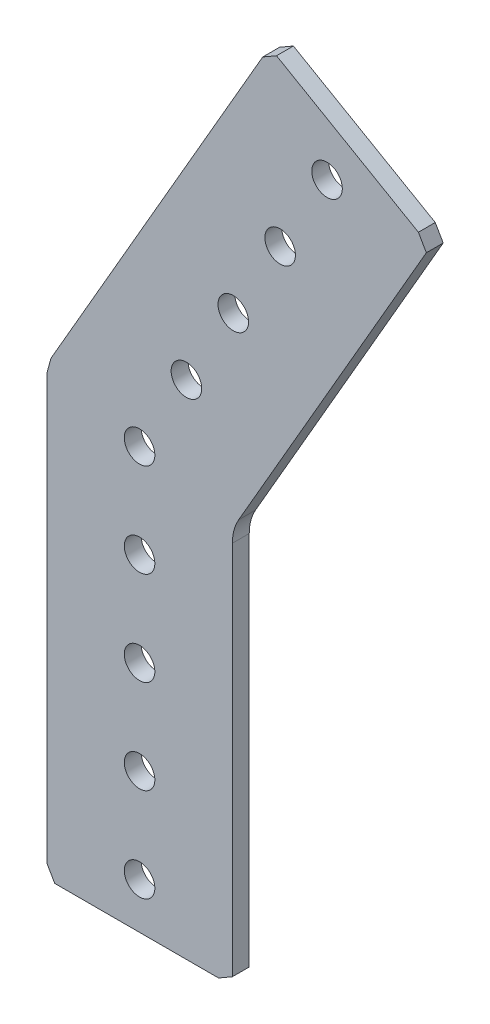
ISO-10303-21;
HEADER;
FILE_DESCRIPTION(('STEP AP214'),'2;1');
FILE_NAME('part.step','',(''),(''),'','','');
FILE_SCHEMA(('AUTOMOTIVE_DESIGN { 1 0 10303 214 1 1 1 1 }'));
ENDSEC;
DATA;
#1=APPLICATION_CONTEXT('core data for automotive mechanical design processes');
#2=APPLICATION_PROTOCOL_DEFINITION('international standard','automotive_design',2000,#1);
#3=PRODUCT_CONTEXT('',#1,'mechanical');
#4=PRODUCT('Part','Part','',(#3));
#5=PRODUCT_RELATED_PRODUCT_CATEGORY('part','',(#4));
#6=PRODUCT_DEFINITION_FORMATION('','',#4);
#7=PRODUCT_DEFINITION_CONTEXT('part definition',#1,'design');
#8=PRODUCT_DEFINITION('design','',#6,#7);
#9=PRODUCT_DEFINITION_SHAPE('','',#8);
#10=(LENGTH_UNIT() NAMED_UNIT(*) SI_UNIT(.MILLI.,.METRE.));
#11=(NAMED_UNIT(*) PLANE_ANGLE_UNIT() SI_UNIT($,.RADIAN.));
#12=(NAMED_UNIT(*) SI_UNIT($,.STERADIAN.) SOLID_ANGLE_UNIT());
#13=UNCERTAINTY_MEASURE_WITH_UNIT(LENGTH_MEASURE(1.E-05),#10,'distance_accuracy_value','');
#14=(GEOMETRIC_REPRESENTATION_CONTEXT(3) GLOBAL_UNCERTAINTY_ASSIGNED_CONTEXT((#13)) GLOBAL_UNIT_ASSIGNED_CONTEXT((#10,
#11,#12)) REPRESENTATION_CONTEXT('',''));
#15=CARTESIAN_POINT('',(0.,0.,0.));
#16=DIRECTION('',(0.,0.,1.));
#17=DIRECTION('',(1.,0.,0.));
#18=AXIS2_PLACEMENT_3D('',#15,#16,#17);
#19=CARTESIAN_POINT('',(18.5578370216028,55.1301165999988,0.));
#20=DIRECTION('',(-0.499999999999878,0.866025403784509,0.));
#21=DIRECTION('',(-0.866025403784509,-0.499999999999878,0.));
#22=AXIS2_PLACEMENT_3D('',#19,#20,#21);
#23=PLANE('',#22);
#24=DIRECTION('',(-0.866025403784509,-0.499999999999878,0.));
#25=VECTOR('',#24,1.);
#26=CARTESIAN_POINT('',(18.5578370216028,55.1301165999988,2.286));
#27=LINE('',#26,#25);
#28=CARTESIAN_POINT('',(18.5578370216028,55.1301165999988,2.286));
#29=VERTEX_POINT('',#28);
#30=CARTESIAN_POINT('',(16.6880881748319,54.050616599999,2.286));
#31=VERTEX_POINT('',#30);
#32=EDGE_CURVE('E153',#29,#31,#27,.T.);
#33=ORIENTED_EDGE('',*,*,#32,.F.);
#34=DIRECTION('',(0.,0.,1.));
#35=VECTOR('',#34,1.);
#36=CARTESIAN_POINT('',(18.5578370216028,55.1301165999988,0.));
#37=LINE('',#36,#35);
#38=CARTESIAN_POINT('',(18.5578370216028,55.1301165999988,0.));
#39=VERTEX_POINT('',#38);
#40=EDGE_CURVE('E11',#39,#29,#37,.T.);
#41=ORIENTED_EDGE('',*,*,#40,.F.);
#42=DIRECTION('',(-0.866025403784509,-0.499999999999878,0.));
#43=VECTOR('',#42,1.);
#44=CARTESIAN_POINT('',(18.5578370216028,55.1301165999988,0.));
#45=LINE('',#44,#43);
#46=CARTESIAN_POINT('',(16.6880881748319,54.050616599999,0.));
#47=VERTEX_POINT('',#46);
#48=EDGE_CURVE('E186',#39,#47,#45,.T.);
#49=ORIENTED_EDGE('',*,*,#48,.T.);
#50=DIRECTION('',(0.,0.,1.));
#51=VECTOR('',#50,1.);
#52=CARTESIAN_POINT('',(16.6880881748319,54.050616599999,0.));
#53=LINE('',#52,#51);
#54=EDGE_CURVE('E35',#47,#31,#53,.T.);
#55=ORIENTED_EDGE('',*,*,#54,.T.);
#56=EDGE_LOOP('',(#33,#41,#49,#55));
#57=FACE_BOUND('',#56,.T.);
#58=ADVANCED_FACE('F32',(#57),#23,.T.);
#59=CARTESIAN_POINT('',(37.7807874017826,44.0317410233832,0.));
#60=DIRECTION('',(0.5,0.866025403784439,0.));
#61=DIRECTION('',(-0.866025403784439,0.5,0.));
#62=AXIS2_PLACEMENT_3D('',#59,#60,#61);
#63=PLANE('',#62);
#64=DIRECTION('',(-0.866025403784439,0.5,0.));
#65=VECTOR('',#64,1.);
#66=CARTESIAN_POINT('',(37.7807874017826,44.0317410233832,2.286));
#67=LINE('',#66,#65);
#68=CARTESIAN_POINT('',(37.7807874017826,44.0317410233832,2.286));
#69=VERTEX_POINT('',#68);
#70=EDGE_CURVE('E184',#69,#29,#67,.T.);
#71=ORIENTED_EDGE('',*,*,#70,.F.);
#72=DIRECTION('',(0.,0.,1.));
#73=VECTOR('',#72,1.);
#74=CARTESIAN_POINT('',(37.7807874017826,44.0317410233832,0.));
#75=LINE('',#74,#73);
#76=CARTESIAN_POINT('',(37.7807874017826,44.0317410233832,0.));
#77=VERTEX_POINT('',#76);
#78=EDGE_CURVE('E41',#77,#69,#75,.T.);
#79=ORIENTED_EDGE('',*,*,#78,.F.);
#80=DIRECTION('',(-0.866025403784439,0.5,0.));
#81=VECTOR('',#80,1.);
#82=CARTESIAN_POINT('',(37.7807874017826,44.0317410233832,0.));
#83=LINE('',#82,#81);
#84=EDGE_CURVE('E143',#77,#39,#83,.T.);
#85=ORIENTED_EDGE('',*,*,#84,.T.);
#86=ORIENTED_EDGE('',*,*,#40,.T.);
#87=EDGE_LOOP('',(#71,#79,#85,#86));
#88=FACE_BOUND('',#87,.T.);
#89=ADVANCED_FACE('F206',(#88),#63,.T.);
#90=CARTESIAN_POINT('',(38.8602874017829,42.161992176612,0.));
#91=DIRECTION('',(0.866025403784439,0.499999999999999,0.));
#92=DIRECTION('',(-0.499999999999999,0.866025403784439,0.));
#93=AXIS2_PLACEMENT_3D('',#90,#91,#92);
#94=PLANE('',#93);
#95=DIRECTION('',(-0.499999999999999,0.866025403784439,0.));
#96=VECTOR('',#95,1.);
#97=CARTESIAN_POINT('',(38.8602874017829,42.161992176612,2.286));
#98=LINE('',#97,#96);
#99=CARTESIAN_POINT('',(38.8602874017829,42.161992176612,2.286));
#100=VERTEX_POINT('',#99);
#101=EDGE_CURVE('E130',#100,#69,#98,.T.);
#102=ORIENTED_EDGE('',*,*,#101,.F.);
#103=DIRECTION('',(0.,0.,1.));
#104=VECTOR('',#103,1.);
#105=CARTESIAN_POINT('',(38.8602874017829,42.161992176612,0.));
#106=LINE('',#105,#104);
#107=CARTESIAN_POINT('',(38.8602874017829,42.161992176612,0.));
#108=VERTEX_POINT('',#107);
#109=EDGE_CURVE('E125',#108,#100,#106,.T.);
#110=ORIENTED_EDGE('',*,*,#109,.F.);
#111=DIRECTION('',(-0.499999999999999,0.866025403784439,0.));
#112=VECTOR('',#111,1.);
#113=CARTESIAN_POINT('',(38.8602874017829,42.161992176612,0.));
#114=LINE('',#113,#112);
#115=EDGE_CURVE('E128',#108,#77,#114,.T.);
#116=ORIENTED_EDGE('',*,*,#115,.T.);
#117=ORIENTED_EDGE('',*,*,#78,.T.);
#118=EDGE_LOOP('',(#102,#110,#116,#117));
#119=FACE_BOUND('',#118,.T.);
#120=ADVANCED_FACE('F127',(#119),#94,.T.);
#121=CARTESIAN_POINT('',(13.4237386859688,-1.89540256837896,0.));
#122=DIRECTION('',(0.866025403784439,-0.5,0.));
#123=DIRECTION('',(0.5,0.866025403784439,0.));
#124=AXIS2_PLACEMENT_3D('',#121,#122,#123);
#125=PLANE('',#124);
#126=DIRECTION('',(0.5,0.866025403784439,0.));
#127=VECTOR('',#126,1.);
#128=CARTESIAN_POINT('',(13.4237386859688,-1.89540256837896,2.286));
#129=LINE('',#128,#127);
#130=CARTESIAN_POINT('',(13.4237386859688,-1.89540256837896,2.286));
#131=VERTEX_POINT('',#130);
#132=EDGE_CURVE('E181',#131,#100,#129,.T.);
#133=ORIENTED_EDGE('',*,*,#132,.F.);
#134=DIRECTION('',(0.,0.,1.));
#135=VECTOR('',#134,1.);
#136=CARTESIAN_POINT('',(13.4237386859688,-1.89540256837896,0.));
#137=LINE('',#136,#135);
#138=CARTESIAN_POINT('',(13.4237386859688,-1.89540256837896,0.));
#139=VERTEX_POINT('',#138);
#140=EDGE_CURVE('E135',#139,#131,#137,.T.);
#141=ORIENTED_EDGE('',*,*,#140,.F.);
#142=DIRECTION('',(0.5,0.866025403784439,0.));
#143=VECTOR('',#142,1.);
#144=CARTESIAN_POINT('',(13.4237386859688,-1.89540256837896,0.));
#145=LINE('',#144,#143);
#146=EDGE_CURVE('E141',#139,#108,#145,.T.);
#147=ORIENTED_EDGE('',*,*,#146,.T.);
#148=ORIENTED_EDGE('',*,*,#109,.T.);
#149=EDGE_LOOP('',(#133,#141,#147,#148));
#150=FACE_BOUND('',#149,.T.);
#151=ADVANCED_FACE('F145',(#150),#125,.T.);
#152=CARTESIAN_POINT('',(18.923,-5.07040256837896,0.));
#153=DIRECTION('',(0.,0.,1.));
#154=DIRECTION('',(1.,0.,0.));
#155=AXIS2_PLACEMENT_3D('',#152,#153,#154);
#156=CYLINDRICAL_SURFACE('',#155,6.35);
#157=CARTESIAN_POINT('',(18.923,-5.07040256837896,2.286));
#158=DIRECTION('',(0.,0.,-1.));
#159=DIRECTION('',(-1.,0.,0.));
#160=AXIS2_PLACEMENT_3D('',#157,#158,#159);
#161=CIRCLE('',#160,6.35);
#162=CARTESIAN_POINT('',(12.573,-5.07040256837896,2.286));
#163=VERTEX_POINT('',#162);
#164=EDGE_CURVE('E178',#163,#131,#161,.T.);
#165=ORIENTED_EDGE('',*,*,#164,.F.);
#166=DIRECTION('',(0.,0.,1.));
#167=VECTOR('',#166,1.);
#168=CARTESIAN_POINT('',(12.573,-5.07040256837896,0.));
#169=LINE('',#168,#167);
#170=CARTESIAN_POINT('',(12.573,-5.07040256837896,0.));
#171=VERTEX_POINT('',#170);
#172=EDGE_CURVE('E190',#171,#163,#169,.T.);
#173=ORIENTED_EDGE('',*,*,#172,.F.);
#174=CARTESIAN_POINT('',(18.923,-5.07040256837896,0.));
#175=DIRECTION('',(0.,0.,-1.));
#176=DIRECTION('',(-1.,0.,0.));
#177=AXIS2_PLACEMENT_3D('',#174,#175,#176);
#178=CIRCLE('',#177,6.35);
#179=EDGE_CURVE('E146',#171,#139,#178,.T.);
#180=ORIENTED_EDGE('',*,*,#179,.T.);
#181=ORIENTED_EDGE('',*,*,#140,.T.);
#182=EDGE_LOOP('',(#165,#173,#180,#181));
#183=FACE_BOUND('',#182,.T.);
#184=ADVANCED_FACE('F219',(#183),#156,.F.);
#185=CARTESIAN_POINT('',(12.573,-55.9435,0.));
#186=DIRECTION('',(1.,0.,0.));
#187=DIRECTION('',(0.,1.,0.));
#188=AXIS2_PLACEMENT_3D('',#185,#186,#187);
#189=PLANE('',#188);
#190=DIRECTION('',(0.,1.,0.));
#191=VECTOR('',#190,1.);
#192=CARTESIAN_POINT('',(12.573,-55.9435,2.286));
#193=LINE('',#192,#191);
#194=CARTESIAN_POINT('',(12.573,-55.9435,2.286));
#195=VERTEX_POINT('',#194);
#196=EDGE_CURVE('E175',#195,#163,#193,.T.);
#197=ORIENTED_EDGE('',*,*,#196,.F.);
#198=DIRECTION('',(0.,0.,1.));
#199=VECTOR('',#198,1.);
#200=CARTESIAN_POINT('',(12.573,-55.9435,0.));
#201=LINE('',#200,#199);
#202=CARTESIAN_POINT('',(12.573,-55.9435,0.));
#203=VERTEX_POINT('',#202);
#204=EDGE_CURVE('E192',#203,#195,#201,.T.);
#205=ORIENTED_EDGE('',*,*,#204,.F.);
#206=DIRECTION('',(0.,1.,0.));
#207=VECTOR('',#206,1.);
#208=CARTESIAN_POINT('',(12.573,-55.9435,0.));
#209=LINE('',#208,#207);
#210=EDGE_CURVE('E148',#203,#171,#209,.T.);
#211=ORIENTED_EDGE('',*,*,#210,.T.);
#212=ORIENTED_EDGE('',*,*,#172,.T.);
#213=EDGE_LOOP('',(#197,#205,#211,#212));
#214=FACE_BOUND('',#213,.T.);
#215=ADVANCED_FACE('F222',(#214),#189,.T.);
#216=CARTESIAN_POINT('',(10.7032511532294,-57.023,0.));
#217=DIRECTION('',(0.500000000000003,-0.866025403784437,0.));
#218=DIRECTION('',(0.866025403784437,0.500000000000003,0.));
#219=AXIS2_PLACEMENT_3D('',#216,#217,#218);
#220=PLANE('',#219);
#221=DIRECTION('',(0.866025403784437,0.500000000000003,0.));
#222=VECTOR('',#221,1.);
#223=CARTESIAN_POINT('',(10.7032511532294,-57.023,2.286));
#224=LINE('',#223,#222);
#225=CARTESIAN_POINT('',(10.7032511532294,-57.023,2.286));
#226=VERTEX_POINT('',#225);
#227=EDGE_CURVE('E172',#226,#195,#224,.T.);
#228=ORIENTED_EDGE('',*,*,#227,.F.);
#229=DIRECTION('',(0.,0.,1.));
#230=VECTOR('',#229,1.);
#231=CARTESIAN_POINT('',(10.7032511532294,-57.023,0.));
#232=LINE('',#231,#230);
#233=CARTESIAN_POINT('',(10.7032511532294,-57.023,0.));
#234=VERTEX_POINT('',#233);
#235=EDGE_CURVE('E194',#234,#226,#232,.T.);
#236=ORIENTED_EDGE('',*,*,#235,.F.);
#237=DIRECTION('',(0.866025403784437,0.500000000000003,0.));
#238=VECTOR('',#237,1.);
#239=CARTESIAN_POINT('',(10.7032511532294,-57.023,0.));
#240=LINE('',#239,#238);
#241=EDGE_CURVE('E366',#234,#203,#240,.T.);
#242=ORIENTED_EDGE('',*,*,#241,.T.);
#243=ORIENTED_EDGE('',*,*,#204,.T.);
#244=EDGE_LOOP('',(#228,#236,#242,#243));
#245=FACE_BOUND('',#244,.T.);
#246=ADVANCED_FACE('F226',(#245),#220,.T.);
#247=CARTESIAN_POINT('',(-11.4935,-57.023,0.));
#248=DIRECTION('',(0.,-1.,0.));
#249=DIRECTION('',(1.,0.,0.));
#250=AXIS2_PLACEMENT_3D('',#247,#248,#249);
#251=PLANE('',#250);
#252=DIRECTION('',(1.,0.,0.));
#253=VECTOR('',#252,1.);
#254=CARTESIAN_POINT('',(-11.4935,-57.023,2.286));
#255=LINE('',#254,#253);
#256=CARTESIAN_POINT('',(-11.4935,-57.023,2.286));
#257=VERTEX_POINT('',#256);
#258=EDGE_CURVE('E169',#257,#226,#255,.T.);
#259=ORIENTED_EDGE('',*,*,#258,.F.);
#260=DIRECTION('',(0.,0.,1.));
#261=VECTOR('',#260,1.);
#262=CARTESIAN_POINT('',(-11.4935,-57.023,0.));
#263=LINE('',#262,#261);
#264=CARTESIAN_POINT('',(-11.4935,-57.023,0.));
#265=VERTEX_POINT('',#264);
#266=EDGE_CURVE('E196',#265,#257,#263,.T.);
#267=ORIENTED_EDGE('',*,*,#266,.F.);
#268=DIRECTION('',(1.,0.,0.));
#269=VECTOR('',#268,1.);
#270=CARTESIAN_POINT('',(-11.4935,-57.023,0.));
#271=LINE('',#270,#269);
#272=EDGE_CURVE('E363',#265,#234,#271,.T.);
#273=ORIENTED_EDGE('',*,*,#272,.T.);
#274=ORIENTED_EDGE('',*,*,#235,.T.);
#275=EDGE_LOOP('',(#259,#267,#273,#274));
#276=FACE_BOUND('',#275,.T.);
#277=ADVANCED_FACE('F230',(#276),#251,.T.);
#278=CARTESIAN_POINT('',(-12.573,-55.1532511532294,0.));
#279=DIRECTION('',(-0.866025403784432,-0.500000000000011,0.));
#280=DIRECTION('',(0.500000000000011,-0.866025403784432,0.));
#281=AXIS2_PLACEMENT_3D('',#278,#279,#280);
#282=PLANE('',#281);
#283=DIRECTION('',(0.500000000000011,-0.866025403784432,0.));
#284=VECTOR('',#283,1.);
#285=CARTESIAN_POINT('',(-12.573,-55.1532511532294,2.286));
#286=LINE('',#285,#284);
#287=CARTESIAN_POINT('',(-12.573,-55.1532511532294,2.286));
#288=VERTEX_POINT('',#287);
#289=EDGE_CURVE('E166',#288,#257,#286,.T.);
#290=ORIENTED_EDGE('',*,*,#289,.F.);
#291=DIRECTION('',(0.,0.,1.));
#292=VECTOR('',#291,1.);
#293=CARTESIAN_POINT('',(-12.573,-55.1532511532294,0.));
#294=LINE('',#293,#292);
#295=CARTESIAN_POINT('',(-12.573,-55.1532511532294,0.));
#296=VERTEX_POINT('',#295);
#297=EDGE_CURVE('E198',#296,#288,#294,.T.);
#298=ORIENTED_EDGE('',*,*,#297,.F.);
#299=DIRECTION('',(0.500000000000011,-0.866025403784432,0.));
#300=VECTOR('',#299,1.);
#301=CARTESIAN_POINT('',(-12.573,-55.1532511532294,0.));
#302=LINE('',#301,#300);
#303=EDGE_CURVE('E360',#296,#265,#302,.T.);
#304=ORIENTED_EDGE('',*,*,#303,.T.);
#305=ORIENTED_EDGE('',*,*,#266,.T.);
#306=EDGE_LOOP('',(#290,#298,#304,#305));
#307=FACE_BOUND('',#306,.T.);
#308=ADVANCED_FACE('F234',(#307),#282,.T.);
#309=CARTESIAN_POINT('',(-12.573,2.25134455968378,0.));
#310=DIRECTION('',(-1.,0.,0.));
#311=DIRECTION('',(0.,-1.,0.));
#312=AXIS2_PLACEMENT_3D('',#309,#310,#311);
#313=PLANE('',#312);
#314=DIRECTION('',(0.,-1.,0.));
#315=VECTOR('',#314,1.);
#316=CARTESIAN_POINT('',(-12.573,2.25134455968378,2.286));
#317=LINE('',#316,#315);
#318=CARTESIAN_POINT('',(-12.573,2.25134455968378,2.286));
#319=VERTEX_POINT('',#318);
#320=EDGE_CURVE('E163',#319,#288,#317,.T.);
#321=ORIENTED_EDGE('',*,*,#320,.F.);
#322=DIRECTION('',(0.,0.,1.));
#323=VECTOR('',#322,1.);
#324=CARTESIAN_POINT('',(-12.573,2.25134455968378,0.));
#325=LINE('',#324,#323);
#326=CARTESIAN_POINT('',(-12.573,2.25134455968378,0.));
#327=VERTEX_POINT('',#326);
#328=EDGE_CURVE('E200',#327,#319,#325,.T.);
#329=ORIENTED_EDGE('',*,*,#328,.F.);
#330=DIRECTION('',(0.,-1.,0.));
#331=VECTOR('',#330,1.);
#332=CARTESIAN_POINT('',(-12.573,2.25134455968378,0.));
#333=LINE('',#332,#331);
#334=EDGE_CURVE('E357',#327,#296,#333,.T.);
#335=ORIENTED_EDGE('',*,*,#334,.T.);
#336=ORIENTED_EDGE('',*,*,#297,.T.);
#337=EDGE_LOOP('',(#321,#329,#335,#336));
#338=FACE_BOUND('',#337,.T.);
#339=ADVANCED_FACE('F238',(#338),#313,.T.);
#340=CARTESIAN_POINT('',(-12.0142096816236,4.33677841864197,0.));
#341=DIRECTION('',(-0.965925826289068,0.258819045102523,0.));
#342=DIRECTION('',(-0.258819045102523,-0.965925826289068,0.));
#343=AXIS2_PLACEMENT_3D('',#340,#341,#342);
#344=PLANE('',#343);
#345=DIRECTION('',(-0.258819045102523,-0.965925826289068,0.));
#346=VECTOR('',#345,1.);
#347=CARTESIAN_POINT('',(-12.0142096816236,4.33677841864197,2.286));
#348=LINE('',#347,#346);
#349=CARTESIAN_POINT('',(-12.0142096816236,4.33677841864197,2.286));
#350=VERTEX_POINT('',#349);
#351=EDGE_CURVE('E160',#350,#319,#348,.T.);
#352=ORIENTED_EDGE('',*,*,#351,.F.);
#353=DIRECTION('',(0.,0.,1.));
#354=VECTOR('',#353,1.);
#355=CARTESIAN_POINT('',(-12.0142096816236,4.33677841864197,0.));
#356=LINE('',#355,#354);
#357=CARTESIAN_POINT('',(-12.0142096816236,4.33677841864197,0.));
#358=VERTEX_POINT('',#357);
#359=EDGE_CURVE('E201',#358,#350,#356,.T.);
#360=ORIENTED_EDGE('',*,*,#359,.F.);
#361=DIRECTION('',(-0.258819045102523,-0.965925826289068,0.));
#362=VECTOR('',#361,1.);
#363=CARTESIAN_POINT('',(-12.0142096816236,4.33677841864197,0.));
#364=LINE('',#363,#362);
#365=EDGE_CURVE('E354',#358,#327,#364,.T.);
#366=ORIENTED_EDGE('',*,*,#365,.T.);
#367=ORIENTED_EDGE('',*,*,#328,.T.);
#368=EDGE_LOOP('',(#352,#360,#366,#367));
#369=FACE_BOUND('',#368,.T.);
#370=ADVANCED_FACE('F242',(#369),#344,.T.);
#371=CARTESIAN_POINT('',(16.6880881748319,54.050616599999,0.));
#372=DIRECTION('',(-0.866025403784442,0.499999999999995,0.));
#373=DIRECTION('',(-0.499999999999995,-0.866025403784442,0.));
#374=AXIS2_PLACEMENT_3D('',#371,#372,#373);
#375=PLANE('',#374);
#376=DIRECTION('',(-0.499999999999995,-0.866025403784442,0.));
#377=VECTOR('',#376,1.);
#378=CARTESIAN_POINT('',(16.6880881748319,54.050616599999,2.286));
#379=LINE('',#378,#377);
#380=EDGE_CURVE('E156',#31,#350,#379,.T.);
#381=ORIENTED_EDGE('',*,*,#380,.F.);
#382=ORIENTED_EDGE('',*,*,#54,.F.);
#383=DIRECTION('',(-0.499999999999995,-0.866025403784442,0.));
#384=VECTOR('',#383,1.);
#385=CARTESIAN_POINT('',(16.6880881748319,54.050616599999,0.));
#386=LINE('',#385,#384);
#387=EDGE_CURVE('E352',#47,#358,#386,.T.);
#388=ORIENTED_EDGE('',*,*,#387,.T.);
#389=ORIENTED_EDGE('',*,*,#359,.T.);
#390=EDGE_LOOP('',(#381,#382,#388,#389));
#391=FACE_BOUND('',#390,.T.);
#392=ADVANCED_FACE('F203',(#391),#375,.T.);
#393=CARTESIAN_POINT('',(18.923,-5.07040256837896,0.));
#394=DIRECTION('',(0.,0.,-1.));
#395=DIRECTION('',(-1.,0.,0.));
#396=AXIS2_PLACEMENT_3D('',#393,#394,#395);
#397=PLANE('',#396);
#398=CARTESIAN_POINT('',(25.3999999999997,43.9940905122496,0.));
#399=DIRECTION('',(0.,0.,1.));
#400=DIRECTION('',(-1.,0.,0.));
#401=AXIS2_PLACEMENT_3D('',#398,#399,#400);
#402=CIRCLE('',#401,2.0701);
#403=CARTESIAN_POINT('',(23.3298999999997,43.9940905122496,0.));
#404=VERTEX_POINT('',#403);
#405=EDGE_CURVE('E297',#404,#404,#402,.T.);
#406=ORIENTED_EDGE('',*,*,#405,.T.);
#407=EDGE_LOOP('',(#406));
#408=FACE_BOUND('',#407,.T.);
#409=CARTESIAN_POINT('',(12.7000000000001,21.9970452561247,0.));
#410=DIRECTION('',(0.,0.,1.));
#411=DIRECTION('',(-1.,0.,0.));
#412=AXIS2_PLACEMENT_3D('',#409,#410,#411);
#413=CIRCLE('',#412,2.0701);
#414=CARTESIAN_POINT('',(10.6299000000001,21.9970452561247,0.));
#415=VERTEX_POINT('',#414);
#416=EDGE_CURVE('E305',#415,#415,#413,.T.);
#417=ORIENTED_EDGE('',*,*,#416,.T.);
#418=EDGE_LOOP('',(#417));
#419=FACE_BOUND('',#418,.T.);
#420=CARTESIAN_POINT('',(6.35000000000005,10.9985226280623,0.));
#421=DIRECTION('',(0.,0.,1.));
#422=DIRECTION('',(-1.,0.,0.));
#423=AXIS2_PLACEMENT_3D('',#420,#421,#422);
#424=CIRCLE('',#423,2.0701);
#425=CARTESIAN_POINT('',(4.27990000000005,10.9985226280623,0.));
#426=VERTEX_POINT('',#425);
#427=EDGE_CURVE('E311',#426,#426,#424,.T.);
#428=ORIENTED_EDGE('',*,*,#427,.T.);
#429=EDGE_LOOP('',(#428));
#430=FACE_BOUND('',#429,.T.);
#431=CARTESIAN_POINT('',(19.0500000000001,32.995567884187,0.));
#432=DIRECTION('',(0.,0.,1.));
#433=DIRECTION('',(-1.,0.,0.));
#434=AXIS2_PLACEMENT_3D('',#431,#432,#433);
#435=CIRCLE('',#434,2.0701);
#436=CARTESIAN_POINT('',(16.9799000000001,32.995567884187,0.));
#437=VERTEX_POINT('',#436);
#438=EDGE_CURVE('E317',#437,#437,#435,.T.);
#439=ORIENTED_EDGE('',*,*,#438,.T.);
#440=EDGE_LOOP('',(#439));
#441=FACE_BOUND('',#440,.T.);
#442=CARTESIAN_POINT('',(0.,-50.8,0.));
#443=DIRECTION('',(0.,0.,1.));
#444=DIRECTION('',(-1.,0.,0.));
#445=AXIS2_PLACEMENT_3D('',#442,#443,#444);
#446=CIRCLE('',#445,2.0701);
#447=CARTESIAN_POINT('',(-2.07009999999999,-50.8,0.));
#448=VERTEX_POINT('',#447);
#449=EDGE_CURVE('E323',#448,#448,#446,.T.);
#450=ORIENTED_EDGE('',*,*,#449,.T.);
#451=EDGE_LOOP('',(#450));
#452=FACE_BOUND('',#451,.T.);
#453=CARTESIAN_POINT('',(2.66050878019847E-13,-25.4,0.));
#454=DIRECTION('',(0.,0.,1.));
#455=DIRECTION('',(-1.,0.,0.));
#456=AXIS2_PLACEMENT_3D('',#453,#454,#455);
#457=CIRCLE('',#456,2.0701);
#458=CARTESIAN_POINT('',(-2.07009999999973,-25.4,0.));
#459=VERTEX_POINT('',#458);
#460=EDGE_CURVE('E329',#459,#459,#457,.T.);
#461=ORIENTED_EDGE('',*,*,#460,.T.);
#462=EDGE_LOOP('',(#461));
#463=FACE_BOUND('',#462,.T.);
#464=CARTESIAN_POINT('',(1.33025439009923E-13,-12.7,0.));
#465=DIRECTION('',(0.,0.,1.));
#466=DIRECTION('',(-1.,0.,0.));
#467=AXIS2_PLACEMENT_3D('',#464,#465,#466);
#468=CIRCLE('',#467,2.0701);
#469=CARTESIAN_POINT('',(-2.07009999999987,-12.7,0.));
#470=VERTEX_POINT('',#469);
#471=EDGE_CURVE('E335',#470,#470,#468,.T.);
#472=ORIENTED_EDGE('',*,*,#471,.T.);
#473=EDGE_LOOP('',(#472));
#474=FACE_BOUND('',#473,.T.);
#475=CARTESIAN_POINT('',(3.9907631702977E-13,-38.1,0.));
#476=DIRECTION('',(0.,0.,1.));
#477=DIRECTION('',(-1.,0.,0.));
#478=AXIS2_PLACEMENT_3D('',#475,#476,#477);
#479=CIRCLE('',#478,2.0701);
#480=CARTESIAN_POINT('',(-2.0700999999996,-38.1,0.));
#481=VERTEX_POINT('',#480);
#482=EDGE_CURVE('E341',#481,#481,#479,.T.);
#483=ORIENTED_EDGE('',*,*,#482,.T.);
#484=EDGE_LOOP('',(#483));
#485=FACE_BOUND('',#484,.T.);
#486=CARTESIAN_POINT('',(0.,0.,0.));
#487=DIRECTION('',(0.,0.,1.));
#488=DIRECTION('',(-1.,0.,0.));
#489=AXIS2_PLACEMENT_3D('',#486,#487,#488);
#490=CIRCLE('',#489,2.0701);
#491=CARTESIAN_POINT('',(-2.0701,0.,0.));
#492=VERTEX_POINT('',#491);
#493=EDGE_CURVE('E157',#492,#492,#490,.T.);
#494=ORIENTED_EDGE('',*,*,#493,.T.);
#495=EDGE_LOOP('',(#494));
#496=FACE_BOUND('',#495,.T.);
#497=ORIENTED_EDGE('',*,*,#48,.F.);
#498=ORIENTED_EDGE('',*,*,#84,.F.);
#499=ORIENTED_EDGE('',*,*,#115,.F.);
#500=ORIENTED_EDGE('',*,*,#146,.F.);
#501=ORIENTED_EDGE('',*,*,#179,.F.);
#502=ORIENTED_EDGE('',*,*,#210,.F.);
#503=ORIENTED_EDGE('',*,*,#241,.F.);
#504=ORIENTED_EDGE('',*,*,#272,.F.);
#505=ORIENTED_EDGE('',*,*,#303,.F.);
#506=ORIENTED_EDGE('',*,*,#334,.F.);
#507=ORIENTED_EDGE('',*,*,#365,.F.);
#508=ORIENTED_EDGE('',*,*,#387,.F.);
#509=EDGE_LOOP('',(#497,#498,#499,#500,#501,#502,#503,#504,#505,#506,#507,#508));
#510=FACE_BOUND('',#509,.T.);
#511=ADVANCED_FACE('F139',(#408,#419,#430,#441,#452,#463,#474,#485,#496,#510),#397,.T.);
#512=CARTESIAN_POINT('',(18.923,-5.07040256837896,2.286));
#513=DIRECTION('',(0.,0.,-1.));
#514=DIRECTION('',(-1.,0.,0.));
#515=AXIS2_PLACEMENT_3D('',#512,#513,#514);
#516=PLANE('',#515);
#517=CARTESIAN_POINT('',(25.3999999999997,43.9940905122496,2.286));
#518=DIRECTION('',(0.,0.,1.));
#519=DIRECTION('',(-1.,0.,0.));
#520=AXIS2_PLACEMENT_3D('',#517,#518,#519);
#521=CIRCLE('',#520,2.0701);
#522=CARTESIAN_POINT('',(23.3298999999997,43.9940905122496,2.286));
#523=VERTEX_POINT('',#522);
#524=EDGE_CURVE('E300',#523,#523,#521,.T.);
#525=ORIENTED_EDGE('',*,*,#524,.F.);
#526=EDGE_LOOP('',(#525));
#527=FACE_BOUND('',#526,.T.);
#528=CARTESIAN_POINT('',(12.7000000000001,21.9970452561247,2.286));
#529=DIRECTION('',(0.,0.,1.));
#530=DIRECTION('',(-1.,0.,0.));
#531=AXIS2_PLACEMENT_3D('',#528,#529,#530);
#532=CIRCLE('',#531,2.0701);
#533=CARTESIAN_POINT('',(10.6299000000001,21.9970452561247,2.286));
#534=VERTEX_POINT('',#533);
#535=EDGE_CURVE('E302',#534,#534,#532,.T.);
#536=ORIENTED_EDGE('',*,*,#535,.F.);
#537=EDGE_LOOP('',(#536));
#538=FACE_BOUND('',#537,.T.);
#539=CARTESIAN_POINT('',(6.35000000000005,10.9985226280623,2.286));
#540=DIRECTION('',(0.,0.,1.));
#541=DIRECTION('',(-1.,0.,0.));
#542=AXIS2_PLACEMENT_3D('',#539,#540,#541);
#543=CIRCLE('',#542,2.0701);
#544=CARTESIAN_POINT('',(4.27990000000005,10.9985226280623,2.286));
#545=VERTEX_POINT('',#544);
#546=EDGE_CURVE('E308',#545,#545,#543,.T.);
#547=ORIENTED_EDGE('',*,*,#546,.F.);
#548=EDGE_LOOP('',(#547));
#549=FACE_BOUND('',#548,.T.);
#550=CARTESIAN_POINT('',(19.0500000000001,32.995567884187,2.286));
#551=DIRECTION('',(0.,0.,1.));
#552=DIRECTION('',(-1.,0.,0.));
#553=AXIS2_PLACEMENT_3D('',#550,#551,#552);
#554=CIRCLE('',#553,2.0701);
#555=CARTESIAN_POINT('',(16.9799000000001,32.995567884187,2.286));
#556=VERTEX_POINT('',#555);
#557=EDGE_CURVE('E314',#556,#556,#554,.T.);
#558=ORIENTED_EDGE('',*,*,#557,.F.);
#559=EDGE_LOOP('',(#558));
#560=FACE_BOUND('',#559,.T.);
#561=CARTESIAN_POINT('',(0.,-50.8,2.286));
#562=DIRECTION('',(0.,0.,1.));
#563=DIRECTION('',(-1.,0.,0.));
#564=AXIS2_PLACEMENT_3D('',#561,#562,#563);
#565=CIRCLE('',#564,2.0701);
#566=CARTESIAN_POINT('',(-2.07009999999999,-50.8,2.286));
#567=VERTEX_POINT('',#566);
#568=EDGE_CURVE('E320',#567,#567,#565,.T.);
#569=ORIENTED_EDGE('',*,*,#568,.F.);
#570=EDGE_LOOP('',(#569));
#571=FACE_BOUND('',#570,.T.);
#572=CARTESIAN_POINT('',(2.66050878019847E-13,-25.4,2.286));
#573=DIRECTION('',(0.,0.,1.));
#574=DIRECTION('',(-1.,0.,0.));
#575=AXIS2_PLACEMENT_3D('',#572,#573,#574);
#576=CIRCLE('',#575,2.0701);
#577=CARTESIAN_POINT('',(-2.07009999999973,-25.4,2.286));
#578=VERTEX_POINT('',#577);
#579=EDGE_CURVE('E326',#578,#578,#576,.T.);
#580=ORIENTED_EDGE('',*,*,#579,.F.);
#581=EDGE_LOOP('',(#580));
#582=FACE_BOUND('',#581,.T.);
#583=CARTESIAN_POINT('',(1.33025439009923E-13,-12.7,2.286));
#584=DIRECTION('',(0.,0.,1.));
#585=DIRECTION('',(-1.,0.,0.));
#586=AXIS2_PLACEMENT_3D('',#583,#584,#585);
#587=CIRCLE('',#586,2.0701);
#588=CARTESIAN_POINT('',(-2.07009999999987,-12.7,2.286));
#589=VERTEX_POINT('',#588);
#590=EDGE_CURVE('E332',#589,#589,#587,.T.);
#591=ORIENTED_EDGE('',*,*,#590,.F.);
#592=EDGE_LOOP('',(#591));
#593=FACE_BOUND('',#592,.T.);
#594=CARTESIAN_POINT('',(3.9907631702977E-13,-38.1,2.286));
#595=DIRECTION('',(0.,0.,1.));
#596=DIRECTION('',(-1.,0.,0.));
#597=AXIS2_PLACEMENT_3D('',#594,#595,#596);
#598=CIRCLE('',#597,2.0701);
#599=CARTESIAN_POINT('',(-2.0700999999996,-38.1,2.286));
#600=VERTEX_POINT('',#599);
#601=EDGE_CURVE('E338',#600,#600,#598,.T.);
#602=ORIENTED_EDGE('',*,*,#601,.F.);
#603=EDGE_LOOP('',(#602));
#604=FACE_BOUND('',#603,.T.);
#605=CARTESIAN_POINT('',(0.,0.,2.286));
#606=DIRECTION('',(0.,0.,1.));
#607=DIRECTION('',(-1.,0.,0.));
#608=AXIS2_PLACEMENT_3D('',#605,#606,#607);
#609=CIRCLE('',#608,2.0701);
#610=CARTESIAN_POINT('',(-2.0701,0.,2.286));
#611=VERTEX_POINT('',#610);
#612=EDGE_CURVE('E344',#611,#611,#609,.T.);
#613=ORIENTED_EDGE('',*,*,#612,.F.);
#614=EDGE_LOOP('',(#613));
#615=FACE_BOUND('',#614,.T.);
#616=ORIENTED_EDGE('',*,*,#32,.T.);
#617=ORIENTED_EDGE('',*,*,#380,.T.);
#618=ORIENTED_EDGE('',*,*,#351,.T.);
#619=ORIENTED_EDGE('',*,*,#320,.T.);
#620=ORIENTED_EDGE('',*,*,#289,.T.);
#621=ORIENTED_EDGE('',*,*,#258,.T.);
#622=ORIENTED_EDGE('',*,*,#227,.T.);
#623=ORIENTED_EDGE('',*,*,#196,.T.);
#624=ORIENTED_EDGE('',*,*,#164,.T.);
#625=ORIENTED_EDGE('',*,*,#132,.T.);
#626=ORIENTED_EDGE('',*,*,#101,.T.);
#627=ORIENTED_EDGE('',*,*,#70,.T.);
#628=EDGE_LOOP('',(#616,#617,#618,#619,#620,#621,#622,#623,#624,#625,#626,#627));
#629=FACE_BOUND('',#628,.T.);
#630=ADVANCED_FACE('F205',(#527,#538,#549,#560,#571,#582,#593,#604,#615,#629),#516,.F.);
#631=CARTESIAN_POINT('',(0.,0.,0.));
#632=DIRECTION('',(0.,0.,1.));
#633=DIRECTION('',(1.,0.,0.));
#634=AXIS2_PLACEMENT_3D('',#631,#632,#633);
#635=CYLINDRICAL_SURFACE('',#634,2.0701);
#636=ORIENTED_EDGE('',*,*,#493,.F.);
#637=EDGE_LOOP('',(#636));
#638=FACE_BOUND('',#637,.T.);
#639=ORIENTED_EDGE('',*,*,#612,.T.);
#640=EDGE_LOOP('',(#639));
#641=FACE_BOUND('',#640,.T.);
#642=ADVANCED_FACE('F254',(#638,#641),#635,.F.);
#643=CARTESIAN_POINT('',(3.9907631702977E-13,-38.1,0.));
#644=DIRECTION('',(0.,0.,1.));
#645=DIRECTION('',(1.,0.,0.));
#646=AXIS2_PLACEMENT_3D('',#643,#644,#645);
#647=CYLINDRICAL_SURFACE('',#646,2.0701);
#648=ORIENTED_EDGE('',*,*,#482,.F.);
#649=EDGE_LOOP('',(#648));
#650=FACE_BOUND('',#649,.T.);
#651=ORIENTED_EDGE('',*,*,#601,.T.);
#652=EDGE_LOOP('',(#651));
#653=FACE_BOUND('',#652,.T.);
#654=ADVANCED_FACE('F261',(#650,#653),#647,.F.);
#655=CARTESIAN_POINT('',(1.33025439009923E-13,-12.7,0.));
#656=DIRECTION('',(0.,0.,1.));
#657=DIRECTION('',(1.,0.,0.));
#658=AXIS2_PLACEMENT_3D('',#655,#656,#657);
#659=CYLINDRICAL_SURFACE('',#658,2.0701);
#660=ORIENTED_EDGE('',*,*,#471,.F.);
#661=EDGE_LOOP('',(#660));
#662=FACE_BOUND('',#661,.T.);
#663=ORIENTED_EDGE('',*,*,#590,.T.);
#664=EDGE_LOOP('',(#663));
#665=FACE_BOUND('',#664,.T.);
#666=ADVANCED_FACE('F265',(#662,#665),#659,.F.);
#667=CARTESIAN_POINT('',(2.66050878019847E-13,-25.4,0.));
#668=DIRECTION('',(0.,0.,1.));
#669=DIRECTION('',(1.,0.,0.));
#670=AXIS2_PLACEMENT_3D('',#667,#668,#669);
#671=CYLINDRICAL_SURFACE('',#670,2.0701);
#672=ORIENTED_EDGE('',*,*,#460,.F.);
#673=EDGE_LOOP('',(#672));
#674=FACE_BOUND('',#673,.T.);
#675=ORIENTED_EDGE('',*,*,#579,.T.);
#676=EDGE_LOOP('',(#675));
#677=FACE_BOUND('',#676,.T.);
#678=ADVANCED_FACE('F269',(#674,#677),#671,.F.);
#679=CARTESIAN_POINT('',(0.,-50.8,0.));
#680=DIRECTION('',(0.,0.,1.));
#681=DIRECTION('',(1.,0.,0.));
#682=AXIS2_PLACEMENT_3D('',#679,#680,#681);
#683=CYLINDRICAL_SURFACE('',#682,2.0701);
#684=ORIENTED_EDGE('',*,*,#449,.F.);
#685=EDGE_LOOP('',(#684));
#686=FACE_BOUND('',#685,.T.);
#687=ORIENTED_EDGE('',*,*,#568,.T.);
#688=EDGE_LOOP('',(#687));
#689=FACE_BOUND('',#688,.T.);
#690=ADVANCED_FACE('F273',(#686,#689),#683,.F.);
#691=CARTESIAN_POINT('',(19.0500000000001,32.995567884187,0.));
#692=DIRECTION('',(0.,0.,1.));
#693=DIRECTION('',(1.,0.,0.));
#694=AXIS2_PLACEMENT_3D('',#691,#692,#693);
#695=CYLINDRICAL_SURFACE('',#694,2.0701);
#696=ORIENTED_EDGE('',*,*,#438,.F.);
#697=EDGE_LOOP('',(#696));
#698=FACE_BOUND('',#697,.T.);
#699=ORIENTED_EDGE('',*,*,#557,.T.);
#700=EDGE_LOOP('',(#699));
#701=FACE_BOUND('',#700,.T.);
#702=ADVANCED_FACE('F277',(#698,#701),#695,.F.);
#703=CARTESIAN_POINT('',(6.35000000000005,10.9985226280623,0.));
#704=DIRECTION('',(0.,0.,1.));
#705=DIRECTION('',(1.,0.,0.));
#706=AXIS2_PLACEMENT_3D('',#703,#704,#705);
#707=CYLINDRICAL_SURFACE('',#706,2.0701);
#708=ORIENTED_EDGE('',*,*,#427,.F.);
#709=EDGE_LOOP('',(#708));
#710=FACE_BOUND('',#709,.T.);
#711=ORIENTED_EDGE('',*,*,#546,.T.);
#712=EDGE_LOOP('',(#711));
#713=FACE_BOUND('',#712,.T.);
#714=ADVANCED_FACE('F281',(#710,#713),#707,.F.);
#715=CARTESIAN_POINT('',(12.7000000000001,21.9970452561247,0.));
#716=DIRECTION('',(0.,0.,1.));
#717=DIRECTION('',(1.,0.,0.));
#718=AXIS2_PLACEMENT_3D('',#715,#716,#717);
#719=CYLINDRICAL_SURFACE('',#718,2.0701);
#720=ORIENTED_EDGE('',*,*,#416,.F.);
#721=EDGE_LOOP('',(#720));
#722=FACE_BOUND('',#721,.T.);
#723=ORIENTED_EDGE('',*,*,#535,.T.);
#724=EDGE_LOOP('',(#723));
#725=FACE_BOUND('',#724,.T.);
#726=ADVANCED_FACE('F285',(#722,#725),#719,.F.);
#727=CARTESIAN_POINT('',(25.3999999999997,43.9940905122496,0.));
#728=DIRECTION('',(0.,0.,1.));
#729=DIRECTION('',(1.,0.,0.));
#730=AXIS2_PLACEMENT_3D('',#727,#728,#729);
#731=CYLINDRICAL_SURFACE('',#730,2.0701);
#732=ORIENTED_EDGE('',*,*,#405,.F.);
#733=EDGE_LOOP('',(#732));
#734=FACE_BOUND('',#733,.T.);
#735=ORIENTED_EDGE('',*,*,#524,.T.);
#736=EDGE_LOOP('',(#735));
#737=FACE_BOUND('',#736,.T.);
#738=ADVANCED_FACE('F289',(#734,#737),#731,.F.);
#739=CLOSED_SHELL('',(#58,#89,#120,#151,#184,#215,#246,#277,#308,#339,#370,#392,#511,#630,#642,
#654,#666,#678,#690,#702,#714,#726,#738));
#740=MANIFOLD_SOLID_BREP('B2',#739);
#741=ADVANCED_BREP_SHAPE_REPRESENTATION('',(#18,#740),#14);
#742=SHAPE_DEFINITION_REPRESENTATION(#9,#741);
ENDSEC;
END-ISO-10303-21;
